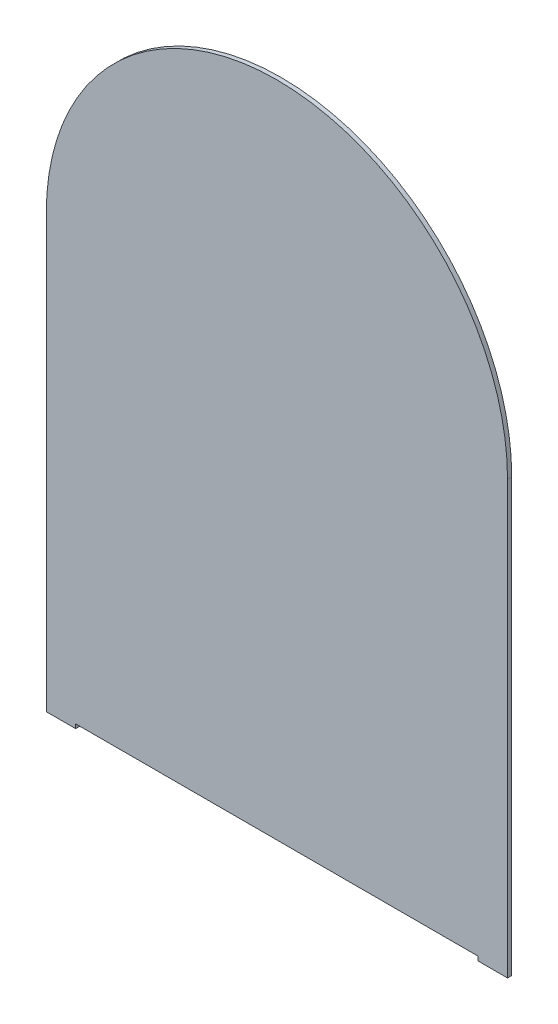
ISO-10303-21;
HEADER;
FILE_DESCRIPTION(('STEP AP214'),'2;1');
FILE_NAME('part.step','',(''),(''),'','','');
FILE_SCHEMA(('AUTOMOTIVE_DESIGN { 1 0 10303 214 1 1 1 1 }'));
ENDSEC;
DATA;
#1=APPLICATION_CONTEXT('core data for automotive mechanical design processes');
#2=APPLICATION_PROTOCOL_DEFINITION('international standard','automotive_design',2000,#1);
#3=PRODUCT_CONTEXT('',#1,'mechanical');
#4=PRODUCT('Part','Part','',(#3));
#5=PRODUCT_RELATED_PRODUCT_CATEGORY('part','',(#4));
#6=PRODUCT_DEFINITION_FORMATION('','',#4);
#7=PRODUCT_DEFINITION_CONTEXT('part definition',#1,'design');
#8=PRODUCT_DEFINITION('design','',#6,#7);
#9=PRODUCT_DEFINITION_SHAPE('','',#8);
#10=(LENGTH_UNIT() NAMED_UNIT(*) SI_UNIT(.MILLI.,.METRE.));
#11=(NAMED_UNIT(*) PLANE_ANGLE_UNIT() SI_UNIT($,.RADIAN.));
#12=(NAMED_UNIT(*) SI_UNIT($,.STERADIAN.) SOLID_ANGLE_UNIT());
#13=UNCERTAINTY_MEASURE_WITH_UNIT(LENGTH_MEASURE(1.E-05),#10,'distance_accuracy_value','');
#14=(GEOMETRIC_REPRESENTATION_CONTEXT(3) GLOBAL_UNCERTAINTY_ASSIGNED_CONTEXT((#13)) GLOBAL_UNIT_ASSIGNED_CONTEXT((#10,
#11,#12)) REPRESENTATION_CONTEXT('',''));
#15=CARTESIAN_POINT('',(0.,0.,0.));
#16=DIRECTION('',(0.,0.,1.));
#17=DIRECTION('',(1.,0.,0.));
#18=AXIS2_PLACEMENT_3D('',#15,#16,#17);
#19=CARTESIAN_POINT('',(0.,-327.025,3.175));
#20=DIRECTION('',(0.,1.,0.));
#21=DIRECTION('',(0.,0.,1.));
#22=AXIS2_PLACEMENT_3D('',#19,#20,#21);
#23=PLANE('',#22);
#24=DIRECTION('',(1.,0.,0.));
#25=VECTOR('',#24,1.);
#26=CARTESIAN_POINT('',(0.,-327.025,0.));
#27=LINE('',#26,#25);
#28=CARTESIAN_POINT('',(0.,-327.025,0.));
#29=VERTEX_POINT('',#28);
#30=CARTESIAN_POINT('',(22.2250000000001,-327.025,0.));
#31=VERTEX_POINT('',#30);
#32=EDGE_CURVE('E124',#29,#31,#27,.T.);
#33=ORIENTED_EDGE('',*,*,#32,.T.);
#34=DIRECTION('',(0.,0.,1.));
#35=VECTOR('',#34,1.);
#36=CARTESIAN_POINT('',(22.2250000000001,-327.025,0.));
#37=LINE('',#36,#35);
#38=CARTESIAN_POINT('',(22.2250000000001,-327.025,3.175));
#39=VERTEX_POINT('',#38);
#40=EDGE_CURVE('E109',#31,#39,#37,.T.);
#41=ORIENTED_EDGE('',*,*,#40,.T.);
#42=DIRECTION('',(1.,0.,0.));
#43=VECTOR('',#42,1.);
#44=CARTESIAN_POINT('',(0.,-327.025,3.175));
#45=LINE('',#44,#43);
#46=CARTESIAN_POINT('',(0.,-327.025,3.175));
#47=VERTEX_POINT('',#46);
#48=EDGE_CURVE('E156',#47,#39,#45,.T.);
#49=ORIENTED_EDGE('',*,*,#48,.F.);
#50=DIRECTION('',(0.,0.,-1.));
#51=VECTOR('',#50,1.);
#52=CARTESIAN_POINT('',(0.,-327.025,3.175));
#53=LINE('',#52,#51);
#54=EDGE_CURVE('E43',#47,#29,#53,.T.);
#55=ORIENTED_EDGE('',*,*,#54,.T.);
#56=EDGE_LOOP('',(#33,#41,#49,#55));
#57=FACE_BOUND('',#56,.T.);
#58=ADVANCED_FACE('F35',(#57),#23,.F.);
#59=CARTESIAN_POINT('',(174.625,0.,3.175));
#60=DIRECTION('',(0.,0.,-1.));
#61=DIRECTION('',(-1.,0.,0.));
#62=AXIS2_PLACEMENT_3D('',#59,#60,#61);
#63=CYLINDRICAL_SURFACE('',#62,174.625);
#64=CARTESIAN_POINT('',(174.625,0.,0.));
#65=DIRECTION('',(0.,0.,1.));
#66=DIRECTION('',(-1.,0.,0.));
#67=AXIS2_PLACEMENT_3D('',#64,#65,#66);
#68=CIRCLE('',#67,174.625);
#69=CARTESIAN_POINT('',(349.25,0.,0.));
#70=VERTEX_POINT('',#69);
#71=CARTESIAN_POINT('',(0.,0.,0.));
#72=VERTEX_POINT('',#71);
#73=EDGE_CURVE('E148',#70,#72,#68,.T.);
#74=ORIENTED_EDGE('',*,*,#73,.T.);
#75=DIRECTION('',(0.,0.,-1.));
#76=VECTOR('',#75,1.);
#77=CARTESIAN_POINT('',(0.,0.,3.175));
#78=LINE('',#77,#76);
#79=CARTESIAN_POINT('',(0.,0.,3.175));
#80=VERTEX_POINT('',#79);
#81=EDGE_CURVE('E11',#80,#72,#78,.T.);
#82=ORIENTED_EDGE('',*,*,#81,.F.);
#83=CARTESIAN_POINT('',(174.625,0.,3.175));
#84=DIRECTION('',(0.,0.,1.));
#85=DIRECTION('',(-1.,0.,0.));
#86=AXIS2_PLACEMENT_3D('',#83,#84,#85);
#87=CIRCLE('',#86,174.625);
#88=CARTESIAN_POINT('',(349.25,0.,3.175));
#89=VERTEX_POINT('',#88);
#90=EDGE_CURVE('E132',#89,#80,#87,.T.);
#91=ORIENTED_EDGE('',*,*,#90,.F.);
#92=DIRECTION('',(0.,0.,-1.));
#93=VECTOR('',#92,1.);
#94=CARTESIAN_POINT('',(349.25,0.,3.175));
#95=LINE('',#94,#93);
#96=EDGE_CURVE('E138',#89,#70,#95,.T.);
#97=ORIENTED_EDGE('',*,*,#96,.T.);
#98=EDGE_LOOP('',(#74,#82,#91,#97));
#99=FACE_BOUND('',#98,.T.);
#100=ADVANCED_FACE('F37',(#99),#63,.T.);
#101=CARTESIAN_POINT('',(0.,0.,3.175));
#102=DIRECTION('',(1.,0.,0.));
#103=DIRECTION('',(0.,1.,0.));
#104=AXIS2_PLACEMENT_3D('',#101,#102,#103);
#105=PLANE('',#104);
#106=DIRECTION('',(0.,-1.,0.));
#107=VECTOR('',#106,1.);
#108=CARTESIAN_POINT('',(0.,0.,0.));
#109=LINE('',#108,#107);
#110=EDGE_CURVE('E134',#72,#29,#109,.T.);
#111=ORIENTED_EDGE('',*,*,#110,.T.);
#112=ORIENTED_EDGE('',*,*,#54,.F.);
#113=DIRECTION('',(0.,-1.,0.));
#114=VECTOR('',#113,1.);
#115=CARTESIAN_POINT('',(0.,0.,3.175));
#116=LINE('',#115,#114);
#117=EDGE_CURVE('E87',#80,#47,#116,.T.);
#118=ORIENTED_EDGE('',*,*,#117,.F.);
#119=ORIENTED_EDGE('',*,*,#81,.T.);
#120=EDGE_LOOP('',(#111,#112,#118,#119));
#121=FACE_BOUND('',#120,.T.);
#122=ADVANCED_FACE('F191',(#121),#105,.F.);
#123=CARTESIAN_POINT('',(327.025,-327.025,3.175));
#124=VERTEX_POINT('',#123);
#125=CARTESIAN_POINT('',(349.25,-327.025,3.175));
#126=VERTEX_POINT('',#125);
#127=EDGE_CURVE('E158',#124,#126,#45,.T.);
#128=ORIENTED_EDGE('',*,*,#127,.F.);
#129=DIRECTION('',(0.,0.,1.));
#130=VECTOR('',#129,1.);
#131=CARTESIAN_POINT('',(327.025,-327.025,0.));
#132=LINE('',#131,#130);
#133=CARTESIAN_POINT('',(327.025,-327.025,0.));
#134=VERTEX_POINT('',#133);
#135=EDGE_CURVE('E119',#134,#124,#132,.T.);
#136=ORIENTED_EDGE('',*,*,#135,.F.);
#137=CARTESIAN_POINT('',(349.25,-327.025,0.));
#138=VERTEX_POINT('',#137);
#139=EDGE_CURVE('E130',#134,#138,#27,.T.);
#140=ORIENTED_EDGE('',*,*,#139,.T.);
#141=DIRECTION('',(0.,0.,-1.));
#142=VECTOR('',#141,1.);
#143=CARTESIAN_POINT('',(349.25,-327.025,3.175));
#144=LINE('',#143,#142);
#145=EDGE_CURVE('E140',#126,#138,#144,.T.);
#146=ORIENTED_EDGE('',*,*,#145,.F.);
#147=EDGE_LOOP('',(#128,#136,#140,#146));
#148=FACE_BOUND('',#147,.T.);
#149=ADVANCED_FACE('F174',(#148),#23,.F.);
#150=CARTESIAN_POINT('',(349.25,0.,3.175));
#151=DIRECTION('',(-1.,0.,0.));
#152=DIRECTION('',(0.,-1.,0.));
#153=AXIS2_PLACEMENT_3D('',#150,#151,#152);
#154=PLANE('',#153);
#155=DIRECTION('',(0.,1.,0.));
#156=VECTOR('',#155,1.);
#157=CARTESIAN_POINT('',(349.25,0.,0.));
#158=LINE('',#157,#156);
#159=EDGE_CURVE('E80',#138,#70,#158,.T.);
#160=ORIENTED_EDGE('',*,*,#159,.T.);
#161=ORIENTED_EDGE('',*,*,#96,.F.);
#162=DIRECTION('',(0.,1.,0.));
#163=VECTOR('',#162,1.);
#164=CARTESIAN_POINT('',(349.25,0.,3.175));
#165=LINE('',#164,#163);
#166=EDGE_CURVE('E59',#126,#89,#165,.T.);
#167=ORIENTED_EDGE('',*,*,#166,.F.);
#168=ORIENTED_EDGE('',*,*,#145,.T.);
#169=EDGE_LOOP('',(#160,#161,#167,#168));
#170=FACE_BOUND('',#169,.T.);
#171=ADVANCED_FACE('F142',(#170),#154,.F.);
#172=CARTESIAN_POINT('',(174.625,0.,3.175));
#173=DIRECTION('',(0.,0.,-1.));
#174=DIRECTION('',(-1.,0.,0.));
#175=AXIS2_PLACEMENT_3D('',#172,#173,#174);
#176=PLANE('',#175);
#177=ORIENTED_EDGE('',*,*,#48,.T.);
#178=DIRECTION('',(0.,-1.,0.));
#179=VECTOR('',#178,1.);
#180=CARTESIAN_POINT('',(22.2250000000001,-323.85,3.175));
#181=LINE('',#180,#179);
#182=CARTESIAN_POINT('',(22.2250000000001,-323.85,3.175));
#183=VERTEX_POINT('',#182);
#184=EDGE_CURVE('E114',#183,#39,#181,.T.);
#185=ORIENTED_EDGE('',*,*,#184,.F.);
#186=DIRECTION('',(-1.,0.,0.));
#187=VECTOR('',#186,1.);
#188=CARTESIAN_POINT('',(22.2250000000001,-323.85,3.175));
#189=LINE('',#188,#187);
#190=CARTESIAN_POINT('',(327.025,-323.85,3.175));
#191=VERTEX_POINT('',#190);
#192=EDGE_CURVE('E127',#191,#183,#189,.T.);
#193=ORIENTED_EDGE('',*,*,#192,.F.);
#194=DIRECTION('',(0.,1.,0.));
#195=VECTOR('',#194,1.);
#196=CARTESIAN_POINT('',(327.025,-323.85,3.175));
#197=LINE('',#196,#195);
#198=EDGE_CURVE('E165',#124,#191,#197,.T.);
#199=ORIENTED_EDGE('',*,*,#198,.F.);
#200=ORIENTED_EDGE('',*,*,#127,.T.);
#201=ORIENTED_EDGE('',*,*,#166,.T.);
#202=ORIENTED_EDGE('',*,*,#90,.T.);
#203=ORIENTED_EDGE('',*,*,#117,.T.);
#204=EDGE_LOOP('',(#177,#185,#193,#199,#200,#201,#202,#203));
#205=FACE_BOUND('',#204,.T.);
#206=ADVANCED_FACE('F175',(#205),#176,.F.);
#207=CARTESIAN_POINT('',(174.625,0.,0.));
#208=DIRECTION('',(0.,0.,-1.));
#209=DIRECTION('',(-1.,0.,0.));
#210=AXIS2_PLACEMENT_3D('',#207,#208,#209);
#211=PLANE('',#210);
#212=DIRECTION('',(0.,-1.,0.));
#213=VECTOR('',#212,1.);
#214=CARTESIAN_POINT('',(22.2250000000001,-323.85,0.));
#215=LINE('',#214,#213);
#216=CARTESIAN_POINT('',(22.2250000000001,-323.85,0.));
#217=VERTEX_POINT('',#216);
#218=EDGE_CURVE('E112',#217,#31,#215,.T.);
#219=ORIENTED_EDGE('',*,*,#218,.T.);
#220=ORIENTED_EDGE('',*,*,#32,.F.);
#221=ORIENTED_EDGE('',*,*,#110,.F.);
#222=ORIENTED_EDGE('',*,*,#73,.F.);
#223=ORIENTED_EDGE('',*,*,#159,.F.);
#224=ORIENTED_EDGE('',*,*,#139,.F.);
#225=DIRECTION('',(0.,1.,0.));
#226=VECTOR('',#225,1.);
#227=CARTESIAN_POINT('',(327.025,-323.85,0.));
#228=LINE('',#227,#226);
#229=CARTESIAN_POINT('',(327.025,-323.85,0.));
#230=VERTEX_POINT('',#229);
#231=EDGE_CURVE('E126',#134,#230,#228,.T.);
#232=ORIENTED_EDGE('',*,*,#231,.T.);
#233=DIRECTION('',(-1.,0.,0.));
#234=VECTOR('',#233,1.);
#235=CARTESIAN_POINT('',(22.2250000000001,-323.85,0.));
#236=LINE('',#235,#234);
#237=EDGE_CURVE('E50',#230,#217,#236,.T.);
#238=ORIENTED_EDGE('',*,*,#237,.T.);
#239=EDGE_LOOP('',(#219,#220,#221,#222,#223,#224,#232,#238));
#240=FACE_BOUND('',#239,.T.);
#241=ADVANCED_FACE('F123',(#240),#211,.T.);
#242=CARTESIAN_POINT('',(22.2250000000001,-323.85,0.));
#243=DIRECTION('',(-1.,0.,0.));
#244=DIRECTION('',(0.,0.,1.));
#245=AXIS2_PLACEMENT_3D('',#242,#243,#244);
#246=PLANE('',#245);
#247=ORIENTED_EDGE('',*,*,#184,.T.);
#248=ORIENTED_EDGE('',*,*,#40,.F.);
#249=ORIENTED_EDGE('',*,*,#218,.F.);
#250=DIRECTION('',(0.,0.,1.));
#251=VECTOR('',#250,1.);
#252=CARTESIAN_POINT('',(22.2250000000001,-323.85,0.));
#253=LINE('',#252,#251);
#254=EDGE_CURVE('E151',#217,#183,#253,.T.);
#255=ORIENTED_EDGE('',*,*,#254,.T.);
#256=EDGE_LOOP('',(#247,#248,#249,#255));
#257=FACE_BOUND('',#256,.T.);
#258=ADVANCED_FACE('F111',(#257),#246,.F.);
#259=CARTESIAN_POINT('',(22.2250000000001,-323.85,0.));
#260=DIRECTION('',(0.,1.,0.));
#261=DIRECTION('',(-1.,0.,0.));
#262=AXIS2_PLACEMENT_3D('',#259,#260,#261);
#263=PLANE('',#262);
#264=ORIENTED_EDGE('',*,*,#192,.T.);
#265=ORIENTED_EDGE('',*,*,#254,.F.);
#266=ORIENTED_EDGE('',*,*,#237,.F.);
#267=DIRECTION('',(0.,0.,1.));
#268=VECTOR('',#267,1.);
#269=CARTESIAN_POINT('',(327.025,-323.85,0.));
#270=LINE('',#269,#268);
#271=EDGE_CURVE('E152',#230,#191,#270,.T.);
#272=ORIENTED_EDGE('',*,*,#271,.T.);
#273=EDGE_LOOP('',(#264,#265,#266,#272));
#274=FACE_BOUND('',#273,.T.);
#275=ADVANCED_FACE('F177',(#274),#263,.F.);
#276=CARTESIAN_POINT('',(327.025,-323.85,0.));
#277=DIRECTION('',(1.,0.,0.));
#278=DIRECTION('',(0.,1.,0.));
#279=AXIS2_PLACEMENT_3D('',#276,#277,#278);
#280=PLANE('',#279);
#281=ORIENTED_EDGE('',*,*,#198,.T.);
#282=ORIENTED_EDGE('',*,*,#271,.F.);
#283=ORIENTED_EDGE('',*,*,#231,.F.);
#284=ORIENTED_EDGE('',*,*,#135,.T.);
#285=EDGE_LOOP('',(#281,#282,#283,#284));
#286=FACE_BOUND('',#285,.T.);
#287=ADVANCED_FACE('F172',(#286),#280,.F.);
#288=CLOSED_SHELL('',(#58,#100,#122,#149,#171,#206,#241,#258,#275,#287));
#289=MANIFOLD_SOLID_BREP('B2',#288);
#290=ADVANCED_BREP_SHAPE_REPRESENTATION('',(#18,#289),#14);
#291=SHAPE_DEFINITION_REPRESENTATION(#9,#290);
ENDSEC;
END-ISO-10303-21;
